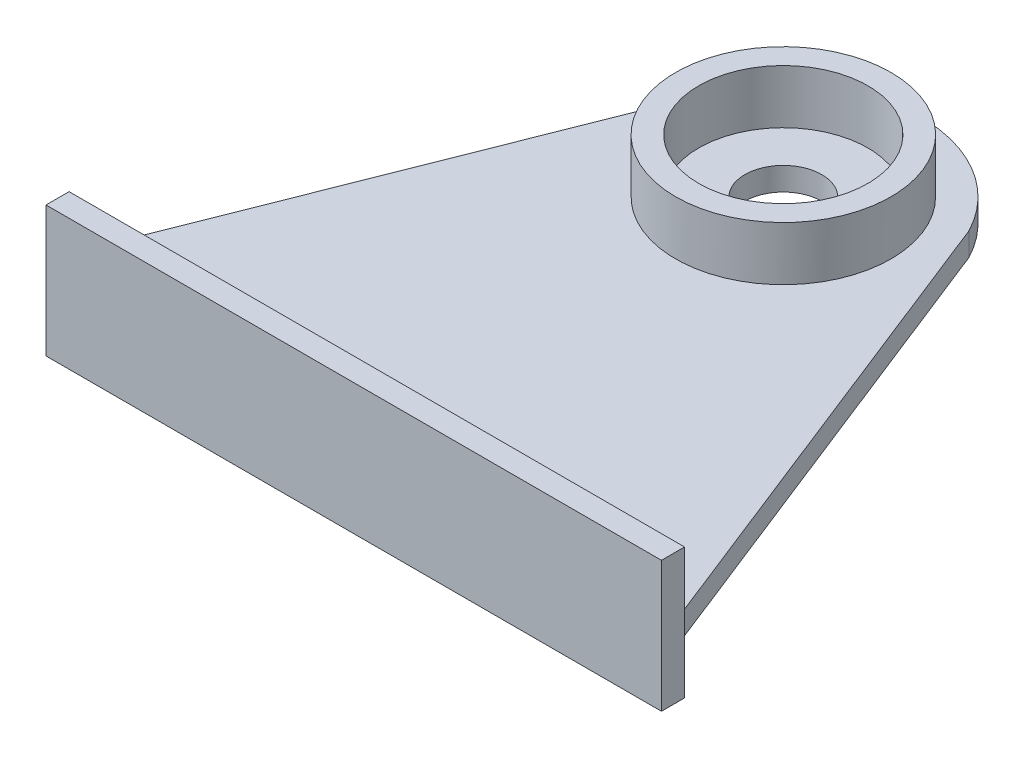
ISO-10303-21;
HEADER;
FILE_DESCRIPTION(('STEP AP214'),'2;1');
FILE_NAME('part.step','',(''),(''),'','','');
FILE_SCHEMA(('AUTOMOTIVE_DESIGN { 1 0 10303 214 1 1 1 1 }'));
ENDSEC;
DATA;
#1=APPLICATION_CONTEXT('core data for automotive mechanical design processes');
#2=APPLICATION_PROTOCOL_DEFINITION('international standard','automotive_design',2000,#1);
#3=PRODUCT_CONTEXT('',#1,'mechanical');
#4=PRODUCT('Part','Part','',(#3));
#5=PRODUCT_RELATED_PRODUCT_CATEGORY('part','',(#4));
#6=PRODUCT_DEFINITION_FORMATION('','',#4);
#7=PRODUCT_DEFINITION_CONTEXT('part definition',#1,'design');
#8=PRODUCT_DEFINITION('design','',#6,#7);
#9=PRODUCT_DEFINITION_SHAPE('','',#8);
#10=(LENGTH_UNIT() NAMED_UNIT(*) SI_UNIT(.MILLI.,.METRE.));
#11=(NAMED_UNIT(*) PLANE_ANGLE_UNIT() SI_UNIT($,.RADIAN.));
#12=(NAMED_UNIT(*) SI_UNIT($,.STERADIAN.) SOLID_ANGLE_UNIT());
#13=UNCERTAINTY_MEASURE_WITH_UNIT(LENGTH_MEASURE(1.E-05),#10,'distance_accuracy_value','');
#14=(GEOMETRIC_REPRESENTATION_CONTEXT(3) GLOBAL_UNCERTAINTY_ASSIGNED_CONTEXT((#13)) GLOBAL_UNIT_ASSIGNED_CONTEXT((#10,
#11,#12)) REPRESENTATION_CONTEXT('',''));
#15=CARTESIAN_POINT('',(0.,0.,0.));
#16=DIRECTION('',(0.,0.,1.));
#17=DIRECTION('',(1.,0.,0.));
#18=AXIS2_PLACEMENT_3D('',#15,#16,#17);
#19=CARTESIAN_POINT('',(-8.92914445149548,3.,-35.0049377267636));
#20=DIRECTION('',(0.,-1.,0.));
#21=DIRECTION('',(0.,0.,-1.));
#22=AXIS2_PLACEMENT_3D('',#19,#20,#21);
#23=PLANE('',#22);
#24=DIRECTION('',(-0.367083952716123,0.,0.930187815260073));
#25=VECTOR('',#24,1.);
#26=CARTESIAN_POINT('',(-24.8438078736417,3.,-43.196988965688));
#27=LINE('',#26,#25);
#28=CARTESIAN_POINT('',(-24.8438078736417,3.,-43.196988965688));
#29=VERTEX_POINT('',#28);
#30=CARTESIAN_POINT('',(-48.9291444514955,3.,17.8350622732364));
#31=VERTEX_POINT('',#30);
#32=EDGE_CURVE('E109',#29,#31,#27,.T.);
#33=ORIENTED_EDGE('',*,*,#32,.T.);
#34=DIRECTION('',(1.,0.,0.));
#35=VECTOR('',#34,1.);
#36=CARTESIAN_POINT('',(-48.9291444514955,3.,17.8350622732364));
#37=LINE('',#36,#35);
#38=CARTESIAN_POINT('',(31.0708555485045,3.,17.8350622732364));
#39=VERTEX_POINT('',#38);
#40=EDGE_CURVE('E100',#31,#39,#37,.T.);
#41=ORIENTED_EDGE('',*,*,#40,.T.);
#42=DIRECTION('',(-0.367083952716123,0.,-0.930187815260073));
#43=VECTOR('',#42,1.);
#44=CARTESIAN_POINT('',(31.0708555485045,3.,17.8350622732364));
#45=LINE('',#44,#43);
#46=CARTESIAN_POINT('',(6.98551897065071,3.,-43.196988965688));
#47=VERTEX_POINT('',#46);
#48=EDGE_CURVE('E107',#39,#47,#45,.T.);
#49=ORIENTED_EDGE('',*,*,#48,.T.);
#50=CARTESIAN_POINT('',(-8.92914445149548,3.,-35.0049377267636));
#51=DIRECTION('',(0.,1.,0.));
#52=DIRECTION('',(0.,0.,-1.));
#53=AXIS2_PLACEMENT_3D('',#50,#51,#52);
#54=CIRCLE('',#53,17.8993356117304);
#55=EDGE_CURVE('E52',#47,#29,#54,.T.);
#56=ORIENTED_EDGE('',*,*,#55,.T.);
#57=EDGE_LOOP('',(#33,#41,#49,#56));
#58=FACE_BOUND('',#57,.T.);
#59=CARTESIAN_POINT('',(-8.92914445149548,3.,-35.0049377267636));
#60=DIRECTION('',(0.,-1.,0.));
#61=DIRECTION('',(0.,0.,-1.));
#62=AXIS2_PLACEMENT_3D('',#59,#60,#61);
#63=CIRCLE('',#62,14.);
#64=CARTESIAN_POINT('',(-8.92914445149548,3.,-49.0049377267636));
#65=VERTEX_POINT('',#64);
#66=EDGE_CURVE('E11',#65,#65,#63,.F.);
#67=ORIENTED_EDGE('',*,*,#66,.F.);
#68=EDGE_LOOP('',(#67));
#69=FACE_BOUND('',#68,.T.);
#70=ADVANCED_FACE('F33',(#58,#69),#23,.F.);
#71=CARTESIAN_POINT('',(-24.8438078736417,3.,-43.196988965688));
#72=DIRECTION('',(0.930187815260072,0.,0.367083952716123));
#73=DIRECTION('',(0.367083952716123,0.,-0.930187815260073));
#74=AXIS2_PLACEMENT_3D('',#71,#72,#73);
#75=PLANE('',#74);
#76=DIRECTION('',(-0.367083952716123,0.,0.930187815260073));
#77=VECTOR('',#76,1.);
#78=CARTESIAN_POINT('',(-24.8438078736417,0.,-43.196988965688));
#79=LINE('',#78,#77);
#80=CARTESIAN_POINT('',(-24.8438078736417,0.,-43.196988965688));
#81=VERTEX_POINT('',#80);
#82=CARTESIAN_POINT('',(-48.9291444514955,0.,17.8350622732364));
#83=VERTEX_POINT('',#82);
#84=EDGE_CURVE('E131',#81,#83,#79,.T.);
#85=ORIENTED_EDGE('',*,*,#84,.T.);
#86=DIRECTION('',(0.,-1.,0.));
#87=VECTOR('',#86,1.);
#88=CARTESIAN_POINT('',(-48.9291444514955,3.,17.8350622732364));
#89=LINE('',#88,#87);
#90=EDGE_CURVE('E43',#31,#83,#89,.T.);
#91=ORIENTED_EDGE('',*,*,#90,.F.);
#92=ORIENTED_EDGE('',*,*,#32,.F.);
#93=DIRECTION('',(0.,-1.,0.));
#94=VECTOR('',#93,1.);
#95=CARTESIAN_POINT('',(-24.8438078736417,3.,-43.196988965688));
#96=LINE('',#95,#94);
#97=EDGE_CURVE('E114',#29,#81,#96,.T.);
#98=ORIENTED_EDGE('',*,*,#97,.T.);
#99=EDGE_LOOP('',(#85,#91,#92,#98));
#100=FACE_BOUND('',#99,.T.);
#101=ADVANCED_FACE('F35',(#100),#75,.F.);
#102=CARTESIAN_POINT('',(31.0708555485045,3.,17.8350622732364));
#103=DIRECTION('',(-0.930187815260072,0.,0.367083952716123));
#104=DIRECTION('',(0.367083952716123,0.,0.930187815260073));
#105=AXIS2_PLACEMENT_3D('',#102,#103,#104);
#106=PLANE('',#105);
#107=DIRECTION('',(-0.367083952716123,0.,-0.930187815260073));
#108=VECTOR('',#107,1.);
#109=CARTESIAN_POINT('',(31.0708555485045,0.,17.8350622732364));
#110=LINE('',#109,#108);
#111=CARTESIAN_POINT('',(31.0708555485045,0.,17.8350622732364));
#112=VERTEX_POINT('',#111);
#113=CARTESIAN_POINT('',(6.98551897065071,0.,-43.196988965688));
#114=VERTEX_POINT('',#113);
#115=EDGE_CURVE('E64',#112,#114,#110,.T.);
#116=ORIENTED_EDGE('',*,*,#115,.T.);
#117=DIRECTION('',(0.,-1.,0.));
#118=VECTOR('',#117,1.);
#119=CARTESIAN_POINT('',(6.98551897065071,3.,-43.196988965688));
#120=LINE('',#119,#118);
#121=EDGE_CURVE('E92',#47,#114,#120,.T.);
#122=ORIENTED_EDGE('',*,*,#121,.F.);
#123=ORIENTED_EDGE('',*,*,#48,.F.);
#124=DIRECTION('',(0.,-1.,0.));
#125=VECTOR('',#124,1.);
#126=CARTESIAN_POINT('',(31.0708555485045,3.,17.8350622732364));
#127=LINE('',#126,#125);
#128=EDGE_CURVE('E82',#39,#112,#127,.T.);
#129=ORIENTED_EDGE('',*,*,#128,.T.);
#130=EDGE_LOOP('',(#116,#122,#123,#129));
#131=FACE_BOUND('',#130,.T.);
#132=ADVANCED_FACE('F112',(#131),#106,.F.);
#133=CARTESIAN_POINT('',(-8.92914445149548,3.,-35.0049377267636));
#134=DIRECTION('',(0.,-1.,0.));
#135=DIRECTION('',(0.,0.,-1.));
#136=AXIS2_PLACEMENT_3D('',#133,#134,#135);
#137=CYLINDRICAL_SURFACE('',#136,17.8993356117304);
#138=CARTESIAN_POINT('',(-8.92914445149548,0.,-35.0049377267636));
#139=DIRECTION('',(0.,1.,0.));
#140=DIRECTION('',(0.,0.,-1.));
#141=AXIS2_PLACEMENT_3D('',#138,#139,#140);
#142=CIRCLE('',#141,17.8993356117304);
#143=EDGE_CURVE('E122',#114,#81,#142,.T.);
#144=ORIENTED_EDGE('',*,*,#143,.T.);
#145=ORIENTED_EDGE('',*,*,#97,.F.);
#146=ORIENTED_EDGE('',*,*,#55,.F.);
#147=ORIENTED_EDGE('',*,*,#121,.T.);
#148=EDGE_LOOP('',(#144,#145,#146,#147));
#149=FACE_BOUND('',#148,.T.);
#150=ADVANCED_FACE('F222',(#149),#137,.T.);
#151=CARTESIAN_POINT('',(-8.92914445149548,0.,-35.0049377267636));
#152=DIRECTION('',(0.,-1.,0.));
#153=DIRECTION('',(0.,0.,-1.));
#154=AXIS2_PLACEMENT_3D('',#151,#152,#153);
#155=PLANE('',#154);
#156=CARTESIAN_POINT('',(-8.92914445149548,0.,-35.0049377267636));
#157=DIRECTION('',(0.,-1.,0.));
#158=DIRECTION('',(0.,0.,-1.));
#159=AXIS2_PLACEMENT_3D('',#156,#157,#158);
#160=CIRCLE('',#159,5.);
#161=CARTESIAN_POINT('',(-8.92914445149548,0.,-40.0049377267636));
#162=VERTEX_POINT('',#161);
#163=EDGE_CURVE('E185',#162,#162,#160,.T.);
#164=ORIENTED_EDGE('',*,*,#163,.F.);
#165=EDGE_LOOP('',(#164));
#166=FACE_BOUND('',#165,.T.);
#167=ORIENTED_EDGE('',*,*,#84,.F.);
#168=ORIENTED_EDGE('',*,*,#143,.F.);
#169=ORIENTED_EDGE('',*,*,#115,.F.);
#170=DIRECTION('',(1.,0.,0.));
#171=VECTOR('',#170,1.);
#172=CARTESIAN_POINT('',(-48.9291444514955,0.,17.8350622732364));
#173=LINE('',#172,#171);
#174=EDGE_CURVE('E74',#83,#112,#173,.T.);
#175=ORIENTED_EDGE('',*,*,#174,.F.);
#176=EDGE_LOOP('',(#167,#168,#169,#175));
#177=FACE_BOUND('',#176,.T.);
#178=ADVANCED_FACE('F219',(#166,#177),#155,.T.);
#179=CARTESIAN_POINT('',(-8.92914445149548,10.,-35.0049377267636));
#180=DIRECTION('',(0.,1.,0.));
#181=DIRECTION('',(0.,0.,1.));
#182=AXIS2_PLACEMENT_3D('',#179,#180,#181);
#183=PLANE('',#182);
#184=CARTESIAN_POINT('',(-8.92914445149548,10.,-35.0049377267636));
#185=DIRECTION('',(0.,1.,0.));
#186=DIRECTION('',(0.,0.,1.));
#187=AXIS2_PLACEMENT_3D('',#184,#185,#186);
#188=CIRCLE('',#187,14.);
#189=CARTESIAN_POINT('',(-8.92914445149548,10.,-21.0049377267636));
#190=VERTEX_POINT('',#189);
#191=EDGE_CURVE('E141',#190,#190,#188,.T.);
#192=ORIENTED_EDGE('',*,*,#191,.T.);
#193=EDGE_LOOP('',(#192));
#194=FACE_BOUND('',#193,.T.);
#195=CARTESIAN_POINT('',(-8.92914445149548,10.,-35.0049377267636));
#196=DIRECTION('',(0.,1.,0.));
#197=DIRECTION('',(0.,0.,1.));
#198=AXIS2_PLACEMENT_3D('',#195,#196,#197);
#199=CIRCLE('',#198,11.);
#200=CARTESIAN_POINT('',(-8.92914445149548,10.,-24.0049377267636));
#201=VERTEX_POINT('',#200);
#202=EDGE_CURVE('E144',#201,#201,#199,.T.);
#203=ORIENTED_EDGE('',*,*,#202,.F.);
#204=EDGE_LOOP('',(#203));
#205=FACE_BOUND('',#204,.T.);
#206=ADVANCED_FACE('F208',(#194,#205),#183,.T.);
#207=CARTESIAN_POINT('',(-8.92914445149548,10.,-35.0049377267636));
#208=DIRECTION('',(0.,-1.,0.));
#209=DIRECTION('',(0.,0.,-1.));
#210=AXIS2_PLACEMENT_3D('',#207,#208,#209);
#211=CYLINDRICAL_SURFACE('',#210,14.);
#212=ORIENTED_EDGE('',*,*,#191,.F.);
#213=EDGE_LOOP('',(#212));
#214=FACE_BOUND('',#213,.T.);
#215=ORIENTED_EDGE('',*,*,#66,.T.);
#216=EDGE_LOOP('',(#215));
#217=FACE_BOUND('',#216,.T.);
#218=ADVANCED_FACE('F202',(#214,#217),#211,.T.);
#219=CARTESIAN_POINT('',(-8.92914445149548,10.,-35.0049377267636));
#220=DIRECTION('',(0.,-1.,0.));
#221=DIRECTION('',(0.,0.,-1.));
#222=AXIS2_PLACEMENT_3D('',#219,#220,#221);
#223=CYLINDRICAL_SURFACE('',#222,11.);
#224=ORIENTED_EDGE('',*,*,#202,.T.);
#225=EDGE_LOOP('',(#224));
#226=FACE_BOUND('',#225,.T.);
#227=CARTESIAN_POINT('',(-8.92914445149548,3.,-35.0049377267636));
#228=DIRECTION('',(0.,1.,0.));
#229=DIRECTION('',(0.,0.,1.));
#230=AXIS2_PLACEMENT_3D('',#227,#228,#229);
#231=CIRCLE('',#230,11.);
#232=CARTESIAN_POINT('',(-8.92914445149548,3.,-24.0049377267636));
#233=VERTEX_POINT('',#232);
#234=EDGE_CURVE('E145',#233,#233,#231,.T.);
#235=ORIENTED_EDGE('',*,*,#234,.F.);
#236=EDGE_LOOP('',(#235));
#237=FACE_BOUND('',#236,.T.);
#238=ADVANCED_FACE('F197',(#226,#237),#223,.F.);
#239=CARTESIAN_POINT('',(-8.92914445149548,3.,-35.0049377267636));
#240=DIRECTION('',(0.,1.,0.));
#241=DIRECTION('',(0.,0.,1.));
#242=AXIS2_PLACEMENT_3D('',#239,#240,#241);
#243=CIRCLE('',#242,5.);
#244=CARTESIAN_POINT('',(-8.92914445149548,3.,-30.0049377267636));
#245=VERTEX_POINT('',#244);
#246=EDGE_CURVE('E188',#245,#245,#243,.T.);
#247=ORIENTED_EDGE('',*,*,#246,.F.);
#248=EDGE_LOOP('',(#247));
#249=FACE_BOUND('',#248,.T.);
#250=ORIENTED_EDGE('',*,*,#234,.T.);
#251=EDGE_LOOP('',(#250));
#252=FACE_BOUND('',#251,.T.);
#253=ADVANCED_FACE('F194',(#249,#252),#23,.F.);
#254=CARTESIAN_POINT('',(0.,0.,17.8350622732364));
#255=DIRECTION('',(0.,0.,-1.));
#256=DIRECTION('',(-1.,0.,0.));
#257=AXIS2_PLACEMENT_3D('',#254,#255,#256);
#258=PLANE('',#257);
#259=ORIENTED_EDGE('',*,*,#40,.F.);
#260=DIRECTION('',(0.,-1.,0.));
#261=VECTOR('',#260,1.);
#262=CARTESIAN_POINT('',(-48.9291444514955,-7.,17.8350622732364));
#263=LINE('',#262,#261);
#264=CARTESIAN_POINT('',(-48.9291444514955,10.,17.8350622732364));
#265=VERTEX_POINT('',#264);
#266=EDGE_CURVE('E170',#265,#31,#263,.T.);
#267=ORIENTED_EDGE('',*,*,#266,.F.);
#268=DIRECTION('',(-1.,0.,0.));
#269=VECTOR('',#268,1.);
#270=CARTESIAN_POINT('',(-48.9291444514955,10.,17.8350622732364));
#271=LINE('',#270,#269);
#272=CARTESIAN_POINT('',(31.0708555485045,10.,17.8350622732364));
#273=VERTEX_POINT('',#272);
#274=EDGE_CURVE('E103',#273,#265,#271,.T.);
#275=ORIENTED_EDGE('',*,*,#274,.F.);
#276=DIRECTION('',(0.,1.,0.));
#277=VECTOR('',#276,1.);
#278=CARTESIAN_POINT('',(31.0708555485045,-7.,17.8350622732364));
#279=LINE('',#278,#277);
#280=EDGE_CURVE('E87',#39,#273,#279,.T.);
#281=ORIENTED_EDGE('',*,*,#280,.F.);
#282=EDGE_LOOP('',(#259,#267,#275,#281));
#283=FACE_BOUND('',#282,.T.);
#284=ADVANCED_FACE('F98',(#283),#258,.T.);
#285=CARTESIAN_POINT('',(-48.9291444514955,-7.,20.8350622732364));
#286=DIRECTION('',(1.,0.,0.));
#287=DIRECTION('',(0.,0.,-1.));
#288=AXIS2_PLACEMENT_3D('',#285,#286,#287);
#289=PLANE('',#288);
#290=ORIENTED_EDGE('',*,*,#266,.T.);
#291=ORIENTED_EDGE('',*,*,#90,.T.);
#292=CARTESIAN_POINT('',(-48.9291444514955,-7.,17.8350622732364));
#293=VERTEX_POINT('',#292);
#294=EDGE_CURVE('E171',#83,#293,#263,.T.);
#295=ORIENTED_EDGE('',*,*,#294,.T.);
#296=DIRECTION('',(0.,0.,-1.));
#297=VECTOR('',#296,1.);
#298=CARTESIAN_POINT('',(-48.9291444514955,-7.,20.8350622732364));
#299=LINE('',#298,#297);
#300=CARTESIAN_POINT('',(-48.9291444514955,-7.,20.8350622732364));
#301=VERTEX_POINT('',#300);
#302=EDGE_CURVE('E148',#301,#293,#299,.T.);
#303=ORIENTED_EDGE('',*,*,#302,.F.);
#304=DIRECTION('',(0.,-1.,0.));
#305=VECTOR('',#304,1.);
#306=CARTESIAN_POINT('',(-48.9291444514955,-7.,20.8350622732364));
#307=LINE('',#306,#305);
#308=CARTESIAN_POINT('',(-48.9291444514955,10.,20.8350622732364));
#309=VERTEX_POINT('',#308);
#310=EDGE_CURVE('E159',#309,#301,#307,.T.);
#311=ORIENTED_EDGE('',*,*,#310,.F.);
#312=DIRECTION('',(0.,0.,-1.));
#313=VECTOR('',#312,1.);
#314=CARTESIAN_POINT('',(-48.9291444514955,10.,20.8350622732364));
#315=LINE('',#314,#313);
#316=EDGE_CURVE('E160',#309,#265,#315,.T.);
#317=ORIENTED_EDGE('',*,*,#316,.T.);
#318=EDGE_LOOP('',(#290,#291,#295,#303,#311,#317));
#319=FACE_BOUND('',#318,.T.);
#320=ADVANCED_FACE('F323',(#319),#289,.F.);
#321=CARTESIAN_POINT('',(-48.9291444514955,-7.,20.8350622732364));
#322=DIRECTION('',(0.,1.,0.));
#323=DIRECTION('',(0.,0.,1.));
#324=AXIS2_PLACEMENT_3D('',#321,#322,#323);
#325=PLANE('',#324);
#326=DIRECTION('',(1.,0.,0.));
#327=VECTOR('',#326,1.);
#328=CARTESIAN_POINT('',(-48.9291444514955,-7.,17.8350622732364));
#329=LINE('',#328,#327);
#330=CARTESIAN_POINT('',(31.0708555485045,-7.,17.8350622732364));
#331=VERTEX_POINT('',#330);
#332=EDGE_CURVE('E104',#293,#331,#329,.T.);
#333=ORIENTED_EDGE('',*,*,#332,.T.);
#334=DIRECTION('',(0.,0.,-1.));
#335=VECTOR('',#334,1.);
#336=CARTESIAN_POINT('',(31.0708555485045,-7.,20.8350622732364));
#337=LINE('',#336,#335);
#338=CARTESIAN_POINT('',(31.0708555485045,-7.,20.8350622732364));
#339=VERTEX_POINT('',#338);
#340=EDGE_CURVE('E166',#339,#331,#337,.T.);
#341=ORIENTED_EDGE('',*,*,#340,.F.);
#342=DIRECTION('',(1.,0.,0.));
#343=VECTOR('',#342,1.);
#344=CARTESIAN_POINT('',(-48.9291444514955,-7.,20.8350622732364));
#345=LINE('',#344,#343);
#346=EDGE_CURVE('E180',#301,#339,#345,.T.);
#347=ORIENTED_EDGE('',*,*,#346,.F.);
#348=ORIENTED_EDGE('',*,*,#302,.T.);
#349=EDGE_LOOP('',(#333,#341,#347,#348));
#350=FACE_BOUND('',#349,.T.);
#351=ADVANCED_FACE('F316',(#350),#325,.F.);
#352=CARTESIAN_POINT('',(31.0708555485045,-7.,20.8350622732364));
#353=DIRECTION('',(-1.,0.,0.));
#354=DIRECTION('',(0.,0.,1.));
#355=AXIS2_PLACEMENT_3D('',#352,#353,#354);
#356=PLANE('',#355);
#357=EDGE_CURVE('E90',#331,#112,#279,.T.);
#358=ORIENTED_EDGE('',*,*,#357,.T.);
#359=ORIENTED_EDGE('',*,*,#128,.F.);
#360=ORIENTED_EDGE('',*,*,#280,.T.);
#361=DIRECTION('',(0.,0.,-1.));
#362=VECTOR('',#361,1.);
#363=CARTESIAN_POINT('',(31.0708555485045,10.,20.8350622732364));
#364=LINE('',#363,#362);
#365=CARTESIAN_POINT('',(31.0708555485045,10.,20.8350622732364));
#366=VERTEX_POINT('',#365);
#367=EDGE_CURVE('E163',#366,#273,#364,.T.);
#368=ORIENTED_EDGE('',*,*,#367,.F.);
#369=DIRECTION('',(0.,1.,0.));
#370=VECTOR('',#369,1.);
#371=CARTESIAN_POINT('',(31.0708555485045,-7.,20.8350622732364));
#372=LINE('',#371,#370);
#373=EDGE_CURVE('E177',#339,#366,#372,.T.);
#374=ORIENTED_EDGE('',*,*,#373,.F.);
#375=ORIENTED_EDGE('',*,*,#340,.T.);
#376=EDGE_LOOP('',(#358,#359,#360,#368,#374,#375));
#377=FACE_BOUND('',#376,.T.);
#378=ADVANCED_FACE('F84',(#377),#356,.F.);
#379=CARTESIAN_POINT('',(-48.9291444514955,10.,20.8350622732364));
#380=DIRECTION('',(0.,-1.,0.));
#381=DIRECTION('',(0.,0.,-1.));
#382=AXIS2_PLACEMENT_3D('',#379,#380,#381);
#383=PLANE('',#382);
#384=ORIENTED_EDGE('',*,*,#274,.T.);
#385=ORIENTED_EDGE('',*,*,#316,.F.);
#386=DIRECTION('',(-1.,0.,0.));
#387=VECTOR('',#386,1.);
#388=CARTESIAN_POINT('',(-48.9291444514955,10.,20.8350622732364));
#389=LINE('',#388,#387);
#390=EDGE_CURVE('E164',#366,#309,#389,.T.);
#391=ORIENTED_EDGE('',*,*,#390,.F.);
#392=ORIENTED_EDGE('',*,*,#367,.T.);
#393=EDGE_LOOP('',(#384,#385,#391,#392));
#394=FACE_BOUND('',#393,.T.);
#395=ADVANCED_FACE('F301',(#394),#383,.F.);
#396=CARTESIAN_POINT('',(0.,0.,20.8350622732364));
#397=DIRECTION('',(0.,0.,-1.));
#398=DIRECTION('',(-1.,0.,0.));
#399=AXIS2_PLACEMENT_3D('',#396,#397,#398);
#400=PLANE('',#399);
#401=ORIENTED_EDGE('',*,*,#310,.T.);
#402=ORIENTED_EDGE('',*,*,#346,.T.);
#403=ORIENTED_EDGE('',*,*,#373,.T.);
#404=ORIENTED_EDGE('',*,*,#390,.T.);
#405=EDGE_LOOP('',(#401,#402,#403,#404));
#406=FACE_BOUND('',#405,.T.);
#407=ADVANCED_FACE('F295',(#406),#400,.F.);
#408=ORIENTED_EDGE('',*,*,#294,.F.);
#409=ORIENTED_EDGE('',*,*,#174,.T.);
#410=ORIENTED_EDGE('',*,*,#357,.F.);
#411=ORIENTED_EDGE('',*,*,#332,.F.);
#412=EDGE_LOOP('',(#408,#409,#410,#411));
#413=FACE_BOUND('',#412,.T.);
#414=ADVANCED_FACE('F285',(#413),#258,.T.);
#415=CARTESIAN_POINT('',(-8.92914445149548,-7.,-35.0049377267636));
#416=DIRECTION('',(0.,1.,0.));
#417=DIRECTION('',(0.,0.,1.));
#418=AXIS2_PLACEMENT_3D('',#415,#416,#417);
#419=CYLINDRICAL_SURFACE('',#418,5.);
#420=ORIENTED_EDGE('',*,*,#163,.T.);
#421=EDGE_LOOP('',(#420));
#422=FACE_BOUND('',#421,.T.);
#423=ORIENTED_EDGE('',*,*,#246,.T.);
#424=EDGE_LOOP('',(#423));
#425=FACE_BOUND('',#424,.T.);
#426=ADVANCED_FACE('F192',(#422,#425),#419,.F.);
#427=CLOSED_SHELL('',(#70,#101,#132,#150,#178,#206,#218,#238,#253,#284,#320,#351,#378,#395,#407,
#414,#426));
#428=MANIFOLD_SOLID_BREP('B2',#427);
#429=ADVANCED_BREP_SHAPE_REPRESENTATION('',(#18,#428),#14);
#430=SHAPE_DEFINITION_REPRESENTATION(#9,#429);
ENDSEC;
END-ISO-10303-21;
